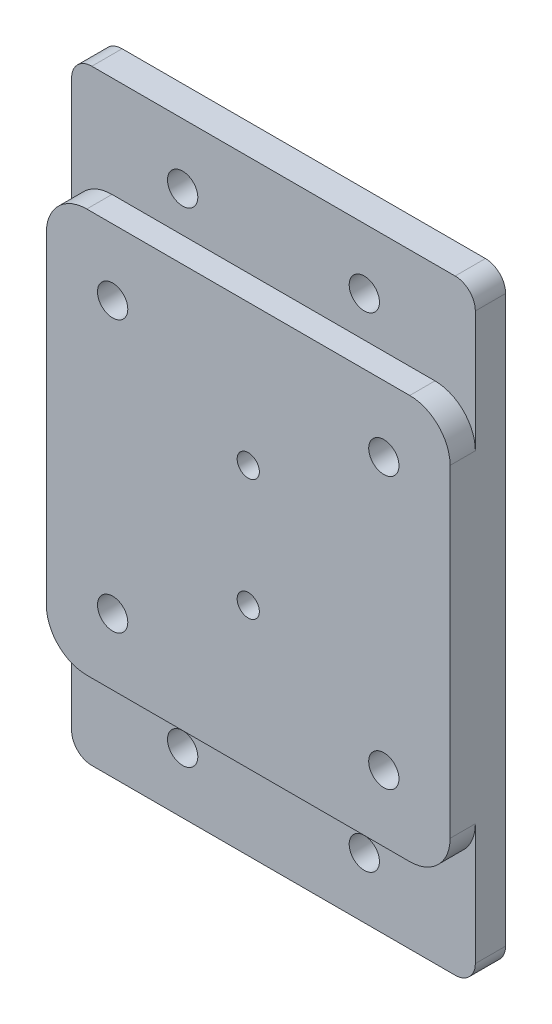
ISO-10303-21;
HEADER;
FILE_DESCRIPTION(('STEP AP214'),'2;1');
FILE_NAME('part.step','',(''),(''),'','','');
FILE_SCHEMA(('AUTOMOTIVE_DESIGN { 1 0 10303 214 1 1 1 1 }'));
ENDSEC;
DATA;
#1=APPLICATION_CONTEXT('core data for automotive mechanical design processes');
#2=APPLICATION_PROTOCOL_DEFINITION('international standard','automotive_design',2000,#1);
#3=PRODUCT_CONTEXT('',#1,'mechanical');
#4=PRODUCT('Part','Part','',(#3));
#5=PRODUCT_RELATED_PRODUCT_CATEGORY('part','',(#4));
#6=PRODUCT_DEFINITION_FORMATION('','',#4);
#7=PRODUCT_DEFINITION_CONTEXT('part definition',#1,'design');
#8=PRODUCT_DEFINITION('design','',#6,#7);
#9=PRODUCT_DEFINITION_SHAPE('','',#8);
#10=(LENGTH_UNIT() NAMED_UNIT(*) SI_UNIT(.MILLI.,.METRE.));
#11=(NAMED_UNIT(*) PLANE_ANGLE_UNIT() SI_UNIT($,.RADIAN.));
#12=(NAMED_UNIT(*) SI_UNIT($,.STERADIAN.) SOLID_ANGLE_UNIT());
#13=UNCERTAINTY_MEASURE_WITH_UNIT(LENGTH_MEASURE(1.E-05),#10,'distance_accuracy_value','');
#14=(GEOMETRIC_REPRESENTATION_CONTEXT(3) GLOBAL_UNCERTAINTY_ASSIGNED_CONTEXT((#13)) GLOBAL_UNIT_ASSIGNED_CONTEXT((#10,
#11,#12)) REPRESENTATION_CONTEXT('',''));
#15=CARTESIAN_POINT('',(0.,0.,0.));
#16=DIRECTION('',(0.,0.,1.));
#17=DIRECTION('',(1.,0.,0.));
#18=AXIS2_PLACEMENT_3D('',#15,#16,#17);
#19=CARTESIAN_POINT('',(-45.0628280341869,0.935555198313801,-3.));
#20=DIRECTION('',(0.,0.,1.));
#21=DIRECTION('',(1.,0.,0.));
#22=AXIS2_PLACEMENT_3D('',#19,#20,#21);
#23=CYLINDRICAL_SURFACE('',#22,1.10000034);
#24=CARTESIAN_POINT('',(-45.0628280341869,0.935555198313801,2.5));
#25=DIRECTION('',(0.,0.,1.));
#26=DIRECTION('',(1.,0.,0.));
#27=AXIS2_PLACEMENT_3D('',#24,#25,#26);
#28=CIRCLE('',#27,1.10000034);
#29=CARTESIAN_POINT('',(-43.9628276941869,0.935555198313801,2.5));
#30=VERTEX_POINT('',#29);
#31=EDGE_CURVE('E248',#30,#30,#28,.T.);
#32=ORIENTED_EDGE('',*,*,#31,.T.);
#33=EDGE_LOOP('',(#32));
#34=FACE_BOUND('',#33,.T.);
#35=CARTESIAN_POINT('',(-45.0628280341869,0.935555198313801,0.));
#36=DIRECTION('',(0.,0.,-1.));
#37=DIRECTION('',(-1.,0.,0.));
#38=AXIS2_PLACEMENT_3D('',#35,#36,#37);
#39=CIRCLE('',#38,1.10000034);
#40=CARTESIAN_POINT('',(-46.1628283741869,0.935555198313801,0.));
#41=VERTEX_POINT('',#40);
#42=EDGE_CURVE('E39',#41,#41,#39,.F.);
#43=ORIENTED_EDGE('',*,*,#42,.F.);
#44=EDGE_LOOP('',(#43));
#45=FACE_BOUND('',#44,.T.);
#46=ADVANCED_FACE('F35',(#34,#45),#23,.F.);
#47=CARTESIAN_POINT('',(-45.0628280341857,12.9355311983138,-3.));
#48=DIRECTION('',(0.,0.,1.));
#49=DIRECTION('',(1.,0.,0.));
#50=AXIS2_PLACEMENT_3D('',#47,#48,#49);
#51=CYLINDRICAL_SURFACE('',#50,1.10000033999999);
#52=CARTESIAN_POINT('',(-45.0628280341857,12.9355311983138,2.5));
#53=DIRECTION('',(0.,0.,1.));
#54=DIRECTION('',(1.,0.,0.));
#55=AXIS2_PLACEMENT_3D('',#52,#53,#54);
#56=CIRCLE('',#55,1.10000033999999);
#57=CARTESIAN_POINT('',(-43.9628276941857,12.9355311983138,2.5));
#58=VERTEX_POINT('',#57);
#59=EDGE_CURVE('E303',#58,#58,#56,.T.);
#60=ORIENTED_EDGE('',*,*,#59,.T.);
#61=EDGE_LOOP('',(#60));
#62=FACE_BOUND('',#61,.T.);
#63=CARTESIAN_POINT('',(-45.0628280341857,12.9355311983138,0.));
#64=DIRECTION('',(0.,0.,-1.));
#65=DIRECTION('',(-1.,0.,0.));
#66=AXIS2_PLACEMENT_3D('',#63,#64,#65);
#67=CIRCLE('',#66,1.10000033999999);
#68=CARTESIAN_POINT('',(-46.1628283741856,12.9355311983138,0.));
#69=VERTEX_POINT('',#68);
#70=EDGE_CURVE('E264',#69,#69,#67,.F.);
#71=ORIENTED_EDGE('',*,*,#70,.F.);
#72=EDGE_LOOP('',(#71));
#73=FACE_BOUND('',#72,.T.);
#74=ADVANCED_FACE('F437',(#62,#73),#51,.F.);
#75=CARTESIAN_POINT('',(-31.6277991916418,20.3705720408582,-3.));
#76=DIRECTION('',(0.,0.,1.));
#77=DIRECTION('',(1.,0.,0.));
#78=AXIS2_PLACEMENT_3D('',#75,#76,#77);
#79=CYLINDRICAL_SURFACE('',#78,1.5);
#80=CARTESIAN_POINT('',(-31.6277991916418,20.3705720408582,2.5));
#81=DIRECTION('',(0.,0.,1.));
#82=DIRECTION('',(1.,0.,0.));
#83=AXIS2_PLACEMENT_3D('',#80,#81,#82);
#84=CIRCLE('',#83,1.5);
#85=CARTESIAN_POINT('',(-30.1277991916418,20.3705720408582,2.5));
#86=VERTEX_POINT('',#85);
#87=EDGE_CURVE('E307',#86,#86,#84,.T.);
#88=ORIENTED_EDGE('',*,*,#87,.T.);
#89=EDGE_LOOP('',(#88));
#90=FACE_BOUND('',#89,.T.);
#91=CARTESIAN_POINT('',(-31.6277991916418,20.3705720408582,0.));
#92=DIRECTION('',(0.,0.,-1.));
#93=DIRECTION('',(-1.,0.,0.));
#94=AXIS2_PLACEMENT_3D('',#91,#92,#93);
#95=CIRCLE('',#94,1.5);
#96=CARTESIAN_POINT('',(-33.1277991916418,20.3705720408582,0.));
#97=VERTEX_POINT('',#96);
#98=EDGE_CURVE('E260',#97,#97,#95,.F.);
#99=ORIENTED_EDGE('',*,*,#98,.F.);
#100=EDGE_LOOP('',(#99));
#101=FACE_BOUND('',#100,.T.);
#102=ADVANCED_FACE('F444',(#90,#101),#79,.F.);
#103=CARTESIAN_POINT('',(-31.627799191642,-6.4994856442307,-3.));
#104=DIRECTION('',(0.,0.,1.));
#105=DIRECTION('',(1.,0.,0.));
#106=AXIS2_PLACEMENT_3D('',#103,#104,#105);
#107=CYLINDRICAL_SURFACE('',#106,1.5);
#108=CARTESIAN_POINT('',(-31.627799191642,-6.4994856442307,2.5));
#109=DIRECTION('',(0.,0.,1.));
#110=DIRECTION('',(1.,0.,0.));
#111=AXIS2_PLACEMENT_3D('',#108,#109,#110);
#112=CIRCLE('',#111,1.5);
#113=CARTESIAN_POINT('',(-30.1277991916419,-6.4994856442307,2.5));
#114=VERTEX_POINT('',#113);
#115=EDGE_CURVE('E311',#114,#114,#112,.T.);
#116=ORIENTED_EDGE('',*,*,#115,.T.);
#117=EDGE_LOOP('',(#116));
#118=FACE_BOUND('',#117,.T.);
#119=CARTESIAN_POINT('',(-31.627799191642,-6.4994856442307,0.));
#120=DIRECTION('',(0.,0.,-1.));
#121=DIRECTION('',(-1.,0.,0.));
#122=AXIS2_PLACEMENT_3D('',#119,#120,#121);
#123=CIRCLE('',#122,1.5);
#124=CARTESIAN_POINT('',(-33.127799191642,-6.4994856442307,0.));
#125=VERTEX_POINT('',#124);
#126=EDGE_CURVE('E255',#125,#125,#123,.F.);
#127=ORIENTED_EDGE('',*,*,#126,.F.);
#128=EDGE_LOOP('',(#127));
#129=FACE_BOUND('',#128,.T.);
#130=ADVANCED_FACE('F457',(#118,#129),#107,.F.);
#131=CARTESIAN_POINT('',(-58.4978568767306,-6.49948564423069,-3.));
#132=DIRECTION('',(0.,0.,1.));
#133=DIRECTION('',(1.,0.,0.));
#134=AXIS2_PLACEMENT_3D('',#131,#132,#133);
#135=CYLINDRICAL_SURFACE('',#134,1.5);
#136=CARTESIAN_POINT('',(-58.4978568767306,-6.49948564423069,2.5));
#137=DIRECTION('',(0.,0.,1.));
#138=DIRECTION('',(1.,0.,0.));
#139=AXIS2_PLACEMENT_3D('',#136,#137,#138);
#140=CIRCLE('',#139,1.5);
#141=CARTESIAN_POINT('',(-56.9978568767306,-6.49948564423069,2.5));
#142=VERTEX_POINT('',#141);
#143=EDGE_CURVE('E308',#142,#142,#140,.T.);
#144=ORIENTED_EDGE('',*,*,#143,.T.);
#145=EDGE_LOOP('',(#144));
#146=FACE_BOUND('',#145,.T.);
#147=CARTESIAN_POINT('',(-58.4978568767306,-6.49948564423069,0.));
#148=DIRECTION('',(0.,0.,-1.));
#149=DIRECTION('',(-1.,0.,0.));
#150=AXIS2_PLACEMENT_3D('',#147,#148,#149);
#151=CIRCLE('',#150,1.5);
#152=CARTESIAN_POINT('',(-59.9978568767306,-6.49948564423069,0.));
#153=VERTEX_POINT('',#152);
#154=EDGE_CURVE('E250',#153,#153,#151,.F.);
#155=ORIENTED_EDGE('',*,*,#154,.F.);
#156=EDGE_LOOP('',(#155));
#157=FACE_BOUND('',#156,.T.);
#158=ADVANCED_FACE('F453',(#146,#157),#135,.F.);
#159=CARTESIAN_POINT('',(-58.4978568767306,20.3705720408583,-3.));
#160=DIRECTION('',(0.,0.,1.));
#161=DIRECTION('',(1.,0.,0.));
#162=AXIS2_PLACEMENT_3D('',#159,#160,#161);
#163=CYLINDRICAL_SURFACE('',#162,1.5);
#164=CARTESIAN_POINT('',(-58.4978568767306,20.3705720408583,2.5));
#165=DIRECTION('',(0.,0.,1.));
#166=DIRECTION('',(1.,0.,0.));
#167=AXIS2_PLACEMENT_3D('',#164,#165,#166);
#168=CIRCLE('',#167,1.5);
#169=CARTESIAN_POINT('',(-56.9978568767306,20.3705720408583,2.5));
#170=VERTEX_POINT('',#169);
#171=EDGE_CURVE('E304',#170,#170,#168,.T.);
#172=ORIENTED_EDGE('',*,*,#171,.T.);
#173=EDGE_LOOP('',(#172));
#174=FACE_BOUND('',#173,.T.);
#175=CARTESIAN_POINT('',(-58.4978568767306,20.3705720408583,0.));
#176=DIRECTION('',(0.,0.,-1.));
#177=DIRECTION('',(-1.,0.,0.));
#178=AXIS2_PLACEMENT_3D('',#175,#176,#177);
#179=CIRCLE('',#178,1.5);
#180=CARTESIAN_POINT('',(-59.9978568767306,20.3705720408583,0.));
#181=VERTEX_POINT('',#180);
#182=EDGE_CURVE('E245',#181,#181,#179,.F.);
#183=ORIENTED_EDGE('',*,*,#182,.F.);
#184=EDGE_LOOP('',(#183));
#185=FACE_BOUND('',#184,.T.);
#186=ADVANCED_FACE('F450',(#174,#185),#163,.F.);
#187=CARTESIAN_POINT('',(-25.0628280341863,26.9355431983138,2.5));
#188=DIRECTION('',(-1.,0.,0.));
#189=DIRECTION('',(0.,-1.,0.));
#190=AXIS2_PLACEMENT_3D('',#187,#188,#189);
#191=PLANE('',#190);
#192=DIRECTION('',(0.,-1.,0.));
#193=VECTOR('',#192,1.);
#194=CARTESIAN_POINT('',(-25.0628280341863,36.9355431983138,0.));
#195=LINE('',#194,#193);
#196=CARTESIAN_POINT('',(-25.0628280341863,-9.06445680168622,0.));
#197=VERTEX_POINT('',#196);
#198=CARTESIAN_POINT('',(-25.0628280341863,-21.0644568016862,0.));
#199=VERTEX_POINT('',#198);
#200=EDGE_CURVE('E340',#197,#199,#195,.T.);
#201=ORIENTED_EDGE('',*,*,#200,.T.);
#202=DIRECTION('',(0.,0.,1.));
#203=VECTOR('',#202,1.);
#204=CARTESIAN_POINT('',(-25.0628280341863,-21.0644568016862,2.5));
#205=LINE('',#204,#203);
#206=CARTESIAN_POINT('',(-25.0628280341863,-21.0644568016862,-3.));
#207=VERTEX_POINT('',#206);
#208=EDGE_CURVE('E225',#199,#207,#205,.F.);
#209=ORIENTED_EDGE('',*,*,#208,.T.);
#210=DIRECTION('',(0.,-1.,0.));
#211=VECTOR('',#210,1.);
#212=CARTESIAN_POINT('',(-25.0628280341863,36.9355431983138,-3.));
#213=LINE('',#212,#211);
#214=CARTESIAN_POINT('',(-25.0628280341863,34.9355431983138,-3.));
#215=VERTEX_POINT('',#214);
#216=EDGE_CURVE('E343',#215,#207,#213,.T.);
#217=ORIENTED_EDGE('',*,*,#216,.F.);
#218=DIRECTION('',(0.,0.,1.));
#219=VECTOR('',#218,1.);
#220=CARTESIAN_POINT('',(-25.0628280341863,34.9355431983138,2.5));
#221=LINE('',#220,#219);
#222=CARTESIAN_POINT('',(-25.0628280341863,34.9355431983138,0.));
#223=VERTEX_POINT('',#222);
#224=EDGE_CURVE('E222',#215,#223,#221,.T.);
#225=ORIENTED_EDGE('',*,*,#224,.T.);
#226=CARTESIAN_POINT('',(-25.0628280341863,22.9355431983138,0.));
#227=VERTEX_POINT('',#226);
#228=EDGE_CURVE('E352',#223,#227,#195,.T.);
#229=ORIENTED_EDGE('',*,*,#228,.T.);
#230=DIRECTION('',(0.,0.,-1.));
#231=VECTOR('',#230,1.);
#232=CARTESIAN_POINT('',(-25.0628280341863,22.9355431983138,2.5));
#233=LINE('',#232,#231);
#234=CARTESIAN_POINT('',(-25.0628280341863,22.9355431983138,2.5));
#235=VERTEX_POINT('',#234);
#236=EDGE_CURVE('E155',#227,#235,#233,.F.);
#237=ORIENTED_EDGE('',*,*,#236,.T.);
#238=DIRECTION('',(0.,1.,0.));
#239=VECTOR('',#238,1.);
#240=CARTESIAN_POINT('',(-25.0628280341863,26.9355431983138,2.5));
#241=LINE('',#240,#239);
#242=CARTESIAN_POINT('',(-25.0628280341863,-9.06445680168622,2.5));
#243=VERTEX_POINT('',#242);
#244=EDGE_CURVE('E178',#243,#235,#241,.T.);
#245=ORIENTED_EDGE('',*,*,#244,.F.);
#246=DIRECTION('',(0.,0.,-1.));
#247=VECTOR('',#246,1.);
#248=CARTESIAN_POINT('',(-25.0628280341863,-9.06445680168622,2.5));
#249=LINE('',#248,#247);
#250=EDGE_CURVE('E168',#243,#197,#249,.T.);
#251=ORIENTED_EDGE('',*,*,#250,.T.);
#252=EDGE_LOOP('',(#201,#209,#217,#225,#229,#237,#245,#251));
#253=FACE_BOUND('',#252,.T.);
#254=ADVANCED_FACE('F382',(#253),#191,.F.);
#255=CARTESIAN_POINT('',(-25.0628280341863,26.9355431983138,2.5));
#256=DIRECTION('',(0.,-1.,0.));
#257=DIRECTION('',(1.,0.,0.));
#258=AXIS2_PLACEMENT_3D('',#255,#256,#257);
#259=PLANE('',#258);
#260=DIRECTION('',(-1.,0.,0.));
#261=VECTOR('',#260,1.);
#262=CARTESIAN_POINT('',(-25.0628280341863,26.9355431983138,2.5));
#263=LINE('',#262,#261);
#264=CARTESIAN_POINT('',(-29.0628280341863,26.9355431983138,2.5));
#265=VERTEX_POINT('',#264);
#266=CARTESIAN_POINT('',(-61.0628280341863,26.9355431983138,2.5));
#267=VERTEX_POINT('',#266);
#268=EDGE_CURVE('E167',#265,#267,#263,.T.);
#269=ORIENTED_EDGE('',*,*,#268,.F.);
#270=DIRECTION('',(0.,0.,-1.));
#271=VECTOR('',#270,1.);
#272=CARTESIAN_POINT('',(-29.0628280341863,26.9355431983138,2.5));
#273=LINE('',#272,#271);
#274=CARTESIAN_POINT('',(-29.0628280341863,26.9355431983138,0.));
#275=VERTEX_POINT('',#274);
#276=EDGE_CURVE('E154',#265,#275,#273,.T.);
#277=ORIENTED_EDGE('',*,*,#276,.T.);
#278=DIRECTION('',(-1.,0.,0.));
#279=VECTOR('',#278,1.);
#280=CARTESIAN_POINT('',(-25.0628280341863,26.9355431983138,0.));
#281=LINE('',#280,#279);
#282=CARTESIAN_POINT('',(-61.0628280341863,26.9355431983138,0.));
#283=VERTEX_POINT('',#282);
#284=EDGE_CURVE('E164',#275,#283,#281,.T.);
#285=ORIENTED_EDGE('',*,*,#284,.T.);
#286=DIRECTION('',(0.,0.,-1.));
#287=VECTOR('',#286,1.);
#288=CARTESIAN_POINT('',(-61.0628280341863,26.9355431983138,2.5));
#289=LINE('',#288,#287);
#290=EDGE_CURVE('E169',#283,#267,#289,.F.);
#291=ORIENTED_EDGE('',*,*,#290,.T.);
#292=EDGE_LOOP('',(#269,#277,#285,#291));
#293=FACE_BOUND('',#292,.T.);
#294=ADVANCED_FACE('F163',(#293),#259,.F.);
#295=CARTESIAN_POINT('',(-65.0628280341863,26.9355431983138,2.5));
#296=DIRECTION('',(1.,0.,0.));
#297=DIRECTION('',(0.,0.,-1.));
#298=AXIS2_PLACEMENT_3D('',#295,#296,#297);
#299=PLANE('',#298);
#300=DIRECTION('',(0.,1.,0.));
#301=VECTOR('',#300,1.);
#302=CARTESIAN_POINT('',(-65.0628280341863,36.9355431983138,-3.));
#303=LINE('',#302,#301);
#304=CARTESIAN_POINT('',(-65.0628280341863,-21.0644568016862,-3.));
#305=VERTEX_POINT('',#304);
#306=CARTESIAN_POINT('',(-65.0628280341863,34.9355431983138,-3.));
#307=VERTEX_POINT('',#306);
#308=EDGE_CURVE('E181',#305,#307,#303,.T.);
#309=ORIENTED_EDGE('',*,*,#308,.F.);
#310=DIRECTION('',(0.,0.,1.));
#311=VECTOR('',#310,1.);
#312=CARTESIAN_POINT('',(-65.0628280341863,-21.0644568016862,2.5));
#313=LINE('',#312,#311);
#314=CARTESIAN_POINT('',(-65.0628280341863,-21.0644568016862,0.));
#315=VERTEX_POINT('',#314);
#316=EDGE_CURVE('E237',#305,#315,#313,.T.);
#317=ORIENTED_EDGE('',*,*,#316,.T.);
#318=DIRECTION('',(0.,1.,0.));
#319=VECTOR('',#318,1.);
#320=CARTESIAN_POINT('',(-65.0628280341863,36.9355431983138,0.));
#321=LINE('',#320,#319);
#322=CARTESIAN_POINT('',(-65.0628280341863,-9.06445680168622,0.));
#323=VERTEX_POINT('',#322);
#324=EDGE_CURVE('E358',#315,#323,#321,.T.);
#325=ORIENTED_EDGE('',*,*,#324,.T.);
#326=DIRECTION('',(0.,0.,-1.));
#327=VECTOR('',#326,1.);
#328=CARTESIAN_POINT('',(-65.0628280341863,-9.06445680168622,2.5));
#329=LINE('',#328,#327);
#330=CARTESIAN_POINT('',(-65.0628280341863,-9.06445680168622,2.5));
#331=VERTEX_POINT('',#330);
#332=EDGE_CURVE('E158',#323,#331,#329,.F.);
#333=ORIENTED_EDGE('',*,*,#332,.T.);
#334=DIRECTION('',(0.,-1.,0.));
#335=VECTOR('',#334,1.);
#336=CARTESIAN_POINT('',(-65.0628280341863,26.9355431983138,2.5));
#337=LINE('',#336,#335);
#338=CARTESIAN_POINT('',(-65.0628280341863,22.9355431983138,2.5));
#339=VERTEX_POINT('',#338);
#340=EDGE_CURVE('E363',#339,#331,#337,.T.);
#341=ORIENTED_EDGE('',*,*,#340,.F.);
#342=DIRECTION('',(0.,0.,-1.));
#343=VECTOR('',#342,1.);
#344=CARTESIAN_POINT('',(-65.0628280341863,22.9355431983138,2.5));
#345=LINE('',#344,#343);
#346=CARTESIAN_POINT('',(-65.0628280341863,22.9355431983138,0.));
#347=VERTEX_POINT('',#346);
#348=EDGE_CURVE('E204',#339,#347,#345,.T.);
#349=ORIENTED_EDGE('',*,*,#348,.T.);
#350=CARTESIAN_POINT('',(-65.0628280341863,34.9355431983138,0.));
#351=VERTEX_POINT('',#350);
#352=EDGE_CURVE('E357',#347,#351,#321,.T.);
#353=ORIENTED_EDGE('',*,*,#352,.T.);
#354=DIRECTION('',(0.,0.,1.));
#355=VECTOR('',#354,1.);
#356=CARTESIAN_POINT('',(-65.0628280341863,34.9355431983138,2.5));
#357=LINE('',#356,#355);
#358=EDGE_CURVE('E235',#351,#307,#357,.F.);
#359=ORIENTED_EDGE('',*,*,#358,.T.);
#360=EDGE_LOOP('',(#309,#317,#325,#333,#341,#349,#353,#359));
#361=FACE_BOUND('',#360,.T.);
#362=ADVANCED_FACE('F391',(#361),#299,.F.);
#363=CARTESIAN_POINT('',(-25.0628280341863,-13.0644568016862,2.5));
#364=DIRECTION('',(0.,1.,0.));
#365=DIRECTION('',(-1.,0.,0.));
#366=AXIS2_PLACEMENT_3D('',#363,#364,#365);
#367=PLANE('',#366);
#368=DIRECTION('',(1.,0.,0.));
#369=VECTOR('',#368,1.);
#370=CARTESIAN_POINT('',(-25.0628280341863,-13.0644568016862,0.));
#371=LINE('',#370,#369);
#372=CARTESIAN_POINT('',(-61.0628280341863,-13.0644568016862,0.));
#373=VERTEX_POINT('',#372);
#374=CARTESIAN_POINT('',(-29.0628280341863,-13.0644568016862,0.));
#375=VERTEX_POINT('',#374);
#376=EDGE_CURVE('E174',#373,#375,#371,.T.);
#377=ORIENTED_EDGE('',*,*,#376,.T.);
#378=DIRECTION('',(0.,0.,-1.));
#379=VECTOR('',#378,1.);
#380=CARTESIAN_POINT('',(-29.0628280341863,-13.0644568016862,2.5));
#381=LINE('',#380,#379);
#382=CARTESIAN_POINT('',(-29.0628280341863,-13.0644568016862,2.5));
#383=VERTEX_POINT('',#382);
#384=EDGE_CURVE('E202',#375,#383,#381,.F.);
#385=ORIENTED_EDGE('',*,*,#384,.T.);
#386=DIRECTION('',(1.,0.,0.));
#387=VECTOR('',#386,1.);
#388=CARTESIAN_POINT('',(-25.0628280341863,-13.0644568016862,2.5));
#389=LINE('',#388,#387);
#390=CARTESIAN_POINT('',(-61.0628280341863,-13.0644568016862,2.5));
#391=VERTEX_POINT('',#390);
#392=EDGE_CURVE('E184',#391,#383,#389,.T.);
#393=ORIENTED_EDGE('',*,*,#392,.F.);
#394=DIRECTION('',(0.,0.,-1.));
#395=VECTOR('',#394,1.);
#396=CARTESIAN_POINT('',(-61.0628280341863,-13.0644568016862,2.5));
#397=LINE('',#396,#395);
#398=EDGE_CURVE('E199',#391,#373,#397,.T.);
#399=ORIENTED_EDGE('',*,*,#398,.T.);
#400=EDGE_LOOP('',(#377,#385,#393,#399));
#401=FACE_BOUND('',#400,.T.);
#402=ADVANCED_FACE('F397',(#401),#367,.F.);
#403=CARTESIAN_POINT('',(0.,0.,2.5));
#404=DIRECTION('',(0.,0.,-1.));
#405=DIRECTION('',(-1.,0.,0.));
#406=AXIS2_PLACEMENT_3D('',#403,#404,#405);
#407=PLANE('',#406);
#408=ORIENTED_EDGE('',*,*,#171,.F.);
#409=EDGE_LOOP('',(#408));
#410=FACE_BOUND('',#409,.T.);
#411=ORIENTED_EDGE('',*,*,#143,.F.);
#412=EDGE_LOOP('',(#411));
#413=FACE_BOUND('',#412,.T.);
#414=ORIENTED_EDGE('',*,*,#115,.F.);
#415=EDGE_LOOP('',(#414));
#416=FACE_BOUND('',#415,.T.);
#417=ORIENTED_EDGE('',*,*,#59,.F.);
#418=EDGE_LOOP('',(#417));
#419=FACE_BOUND('',#418,.T.);
#420=ORIENTED_EDGE('',*,*,#31,.F.);
#421=EDGE_LOOP('',(#420));
#422=FACE_BOUND('',#421,.T.);
#423=ORIENTED_EDGE('',*,*,#87,.F.);
#424=EDGE_LOOP('',(#423));
#425=FACE_BOUND('',#424,.T.);
#426=ORIENTED_EDGE('',*,*,#244,.T.);
#427=CARTESIAN_POINT('',(-29.0628280341863,22.9355431983138,2.5));
#428=DIRECTION('',(0.,0.,-1.));
#429=DIRECTION('',(-1.,0.,0.));
#430=AXIS2_PLACEMENT_3D('',#427,#428,#429);
#431=CIRCLE('',#430,4.);
#432=EDGE_CURVE('E197',#235,#265,#431,.F.);
#433=ORIENTED_EDGE('',*,*,#432,.T.);
#434=ORIENTED_EDGE('',*,*,#268,.T.);
#435=CARTESIAN_POINT('',(-61.0628280341863,22.9355431983138,2.5));
#436=DIRECTION('',(0.,0.,-1.));
#437=DIRECTION('',(-1.,0.,0.));
#438=AXIS2_PLACEMENT_3D('',#435,#436,#437);
#439=CIRCLE('',#438,4.);
#440=EDGE_CURVE('E191',#267,#339,#439,.F.);
#441=ORIENTED_EDGE('',*,*,#440,.T.);
#442=ORIENTED_EDGE('',*,*,#340,.T.);
#443=CARTESIAN_POINT('',(-61.0628280341863,-9.06445680168622,2.5));
#444=DIRECTION('',(0.,0.,-1.));
#445=DIRECTION('',(-1.,0.,0.));
#446=AXIS2_PLACEMENT_3D('',#443,#444,#445);
#447=CIRCLE('',#446,4.);
#448=EDGE_CURVE('E193',#331,#391,#447,.F.);
#449=ORIENTED_EDGE('',*,*,#448,.T.);
#450=ORIENTED_EDGE('',*,*,#392,.T.);
#451=CARTESIAN_POINT('',(-29.0628280341863,-9.06445680168622,2.5));
#452=DIRECTION('',(0.,0.,-1.));
#453=DIRECTION('',(-1.,0.,0.));
#454=AXIS2_PLACEMENT_3D('',#451,#452,#453);
#455=CIRCLE('',#454,4.);
#456=EDGE_CURVE('E195',#383,#243,#455,.F.);
#457=ORIENTED_EDGE('',*,*,#456,.T.);
#458=EDGE_LOOP('',(#426,#433,#434,#441,#442,#449,#450,#457));
#459=FACE_BOUND('',#458,.T.);
#460=ADVANCED_FACE('F371',(#410,#413,#416,#419,#422,#425,#459),#407,.F.);
#461=CARTESIAN_POINT('',(0.,0.,0.));
#462=DIRECTION('',(0.,0.,1.));
#463=DIRECTION('',(1.,0.,0.));
#464=AXIS2_PLACEMENT_3D('',#461,#462,#463);
#465=PLANE('',#464);
#466=CARTESIAN_POINT('',(-36.0628280341863,-17.0644568016862,0.));
#467=DIRECTION('',(0.,0.,-1.));
#468=DIRECTION('',(-1.,0.,0.));
#469=AXIS2_PLACEMENT_3D('',#466,#467,#468);
#470=CIRCLE('',#469,1.5);
#471=CARTESIAN_POINT('',(-37.5628280341863,-17.0644568016862,0.));
#472=VERTEX_POINT('',#471);
#473=EDGE_CURVE('E318',#472,#472,#470,.T.);
#474=ORIENTED_EDGE('',*,*,#473,.T.);
#475=EDGE_LOOP('',(#474));
#476=FACE_BOUND('',#475,.T.);
#477=CARTESIAN_POINT('',(-54.0628280341863,-17.0644568016862,0.));
#478=DIRECTION('',(0.,0.,-1.));
#479=DIRECTION('',(-1.,0.,0.));
#480=AXIS2_PLACEMENT_3D('',#477,#478,#479);
#481=CIRCLE('',#480,1.5);
#482=CARTESIAN_POINT('',(-55.5628280341863,-17.0644568016862,0.));
#483=VERTEX_POINT('',#482);
#484=EDGE_CURVE('E322',#483,#483,#481,.T.);
#485=ORIENTED_EDGE('',*,*,#484,.T.);
#486=EDGE_LOOP('',(#485));
#487=FACE_BOUND('',#486,.T.);
#488=DIRECTION('',(-1.,0.,0.));
#489=VECTOR('',#488,1.);
#490=CARTESIAN_POINT('',(-65.0628280341863,-23.0644568016862,0.));
#491=LINE('',#490,#489);
#492=CARTESIAN_POINT('',(-27.0628280341863,-23.0644568016862,0.));
#493=VERTEX_POINT('',#492);
#494=CARTESIAN_POINT('',(-63.0628280341863,-23.0644568016862,0.));
#495=VERTEX_POINT('',#494);
#496=EDGE_CURVE('E354',#493,#495,#491,.T.);
#497=ORIENTED_EDGE('',*,*,#496,.F.);
#498=CARTESIAN_POINT('',(-27.0628280341863,-21.0644568016862,0.));
#499=DIRECTION('',(0.,0.,1.));
#500=DIRECTION('',(1.,0.,0.));
#501=AXIS2_PLACEMENT_3D('',#498,#499,#500);
#502=CIRCLE('',#501,2.);
#503=EDGE_CURVE('E220',#493,#199,#502,.T.);
#504=ORIENTED_EDGE('',*,*,#503,.T.);
#505=ORIENTED_EDGE('',*,*,#200,.F.);
#506=CARTESIAN_POINT('',(-29.0628280341863,-9.06445680168622,0.));
#507=DIRECTION('',(0.,0.,1.));
#508=DIRECTION('',(1.,0.,0.));
#509=AXIS2_PLACEMENT_3D('',#506,#507,#508);
#510=CIRCLE('',#509,4.);
#511=EDGE_CURVE('E157',#197,#375,#510,.F.);
#512=ORIENTED_EDGE('',*,*,#511,.T.);
#513=ORIENTED_EDGE('',*,*,#376,.F.);
#514=CARTESIAN_POINT('',(-61.0628280341863,-9.06445680168622,0.));
#515=DIRECTION('',(0.,0.,1.));
#516=DIRECTION('',(1.,0.,0.));
#517=AXIS2_PLACEMENT_3D('',#514,#515,#516);
#518=CIRCLE('',#517,4.);
#519=EDGE_CURVE('E209',#373,#323,#518,.F.);
#520=ORIENTED_EDGE('',*,*,#519,.T.);
#521=ORIENTED_EDGE('',*,*,#324,.F.);
#522=CARTESIAN_POINT('',(-63.0628280341863,-21.0644568016862,0.));
#523=DIRECTION('',(0.,0.,1.));
#524=DIRECTION('',(1.,0.,0.));
#525=AXIS2_PLACEMENT_3D('',#522,#523,#524);
#526=CIRCLE('',#525,2.);
#527=EDGE_CURVE('E218',#315,#495,#526,.T.);
#528=ORIENTED_EDGE('',*,*,#527,.T.);
#529=EDGE_LOOP('',(#497,#504,#505,#512,#513,#520,#521,#528));
#530=FACE_BOUND('',#529,.T.);
#531=ADVANCED_FACE('F400',(#476,#487,#530),#465,.T.);
#532=CARTESIAN_POINT('',(-54.0628280341863,30.9355431983138,0.));
#533=DIRECTION('',(0.,0.,-1.));
#534=DIRECTION('',(-1.,0.,0.));
#535=AXIS2_PLACEMENT_3D('',#532,#533,#534);
#536=CIRCLE('',#535,1.5);
#537=CARTESIAN_POINT('',(-55.5628280341863,30.9355431983138,0.));
#538=VERTEX_POINT('',#537);
#539=EDGE_CURVE('E328',#538,#538,#536,.T.);
#540=ORIENTED_EDGE('',*,*,#539,.T.);
#541=EDGE_LOOP('',(#540));
#542=FACE_BOUND('',#541,.T.);
#543=CARTESIAN_POINT('',(-36.0628280341863,30.9355431983138,0.));
#544=DIRECTION('',(0.,0.,-1.));
#545=DIRECTION('',(-1.,0.,0.));
#546=AXIS2_PLACEMENT_3D('',#543,#544,#545);
#547=CIRCLE('',#546,1.5);
#548=CARTESIAN_POINT('',(-37.5628280341863,30.9355431983138,0.));
#549=VERTEX_POINT('',#548);
#550=EDGE_CURVE('E334',#549,#549,#547,.T.);
#551=ORIENTED_EDGE('',*,*,#550,.T.);
#552=EDGE_LOOP('',(#551));
#553=FACE_BOUND('',#552,.T.);
#554=DIRECTION('',(1.,0.,0.));
#555=VECTOR('',#554,1.);
#556=CARTESIAN_POINT('',(-65.0628280341863,36.9355431983138,0.));
#557=LINE('',#556,#555);
#558=CARTESIAN_POINT('',(-63.0628280341863,36.9355431983138,0.));
#559=VERTEX_POINT('',#558);
#560=CARTESIAN_POINT('',(-27.0628280341863,36.9355431983138,0.));
#561=VERTEX_POINT('',#560);
#562=EDGE_CURVE('E347',#559,#561,#557,.T.);
#563=ORIENTED_EDGE('',*,*,#562,.F.);
#564=CARTESIAN_POINT('',(-63.0628280341863,34.9355431983138,0.));
#565=DIRECTION('',(0.,0.,1.));
#566=DIRECTION('',(1.,0.,0.));
#567=AXIS2_PLACEMENT_3D('',#564,#565,#566);
#568=CIRCLE('',#567,2.);
#569=EDGE_CURVE('E11',#559,#351,#568,.T.);
#570=ORIENTED_EDGE('',*,*,#569,.T.);
#571=ORIENTED_EDGE('',*,*,#352,.F.);
#572=CARTESIAN_POINT('',(-61.0628280341863,22.9355431983138,0.));
#573=DIRECTION('',(0.,0.,1.));
#574=DIRECTION('',(1.,0.,0.));
#575=AXIS2_PLACEMENT_3D('',#572,#573,#574);
#576=CIRCLE('',#575,4.);
#577=EDGE_CURVE('E173',#347,#283,#576,.F.);
#578=ORIENTED_EDGE('',*,*,#577,.T.);
#579=ORIENTED_EDGE('',*,*,#284,.F.);
#580=CARTESIAN_POINT('',(-29.0628280341863,22.9355431983138,0.));
#581=DIRECTION('',(0.,0.,1.));
#582=DIRECTION('',(1.,0.,0.));
#583=AXIS2_PLACEMENT_3D('',#580,#581,#582);
#584=CIRCLE('',#583,4.);
#585=EDGE_CURVE('E150',#275,#227,#584,.F.);
#586=ORIENTED_EDGE('',*,*,#585,.T.);
#587=ORIENTED_EDGE('',*,*,#228,.F.);
#588=CARTESIAN_POINT('',(-27.0628280341863,34.9355431983138,0.));
#589=DIRECTION('',(0.,0.,1.));
#590=DIRECTION('',(1.,0.,0.));
#591=AXIS2_PLACEMENT_3D('',#588,#589,#590);
#592=CIRCLE('',#591,2.);
#593=EDGE_CURVE('E44',#223,#561,#592,.T.);
#594=ORIENTED_EDGE('',*,*,#593,.T.);
#595=EDGE_LOOP('',(#563,#570,#571,#578,#579,#586,#587,#594));
#596=FACE_BOUND('',#595,.T.);
#597=ADVANCED_FACE('F171',(#542,#553,#596),#465,.T.);
#598=CARTESIAN_POINT('',(0.,0.,-3.));
#599=DIRECTION('',(0.,0.,1.));
#600=DIRECTION('',(1.,0.,0.));
#601=AXIS2_PLACEMENT_3D('',#598,#599,#600);
#602=PLANE('',#601);
#603=CARTESIAN_POINT('',(-45.0628280341857,12.9355311983138,-3.));
#604=DIRECTION('',(0.,0.,-1.));
#605=DIRECTION('',(-1.,0.,0.));
#606=AXIS2_PLACEMENT_3D('',#603,#604,#605);
#607=CIRCLE('',#606,2.);
#608=CARTESIAN_POINT('',(-47.0628280341857,12.9355311983138,-3.));
#609=VERTEX_POINT('',#608);
#610=EDGE_CURVE('E272',#609,#609,#607,.T.);
#611=ORIENTED_EDGE('',*,*,#610,.F.);
#612=EDGE_LOOP('',(#611));
#613=FACE_BOUND('',#612,.T.);
#614=CARTESIAN_POINT('',(-45.0628280341869,0.935555198313801,-3.));
#615=DIRECTION('',(0.,0.,-1.));
#616=DIRECTION('',(-1.,0.,0.));
#617=AXIS2_PLACEMENT_3D('',#614,#615,#616);
#618=CIRCLE('',#617,2.);
#619=CARTESIAN_POINT('',(-47.0628280341869,0.935555198313801,-3.));
#620=VERTEX_POINT('',#619);
#621=EDGE_CURVE('E282',#620,#620,#618,.T.);
#622=ORIENTED_EDGE('',*,*,#621,.F.);
#623=EDGE_LOOP('',(#622));
#624=FACE_BOUND('',#623,.T.);
#625=CARTESIAN_POINT('',(-31.627799191642,20.3705720408583,-3.));
#626=DIRECTION('',(0.,0.,1.));
#627=DIRECTION('',(1.,0.,0.));
#628=AXIS2_PLACEMENT_3D('',#625,#626,#627);
#629=CIRCLE('',#628,3.);
#630=CARTESIAN_POINT('',(-28.627799191642,20.3705720408583,-3.));
#631=VERTEX_POINT('',#630);
#632=EDGE_CURVE('E270',#631,#631,#629,.T.);
#633=ORIENTED_EDGE('',*,*,#632,.T.);
#634=EDGE_LOOP('',(#633));
#635=FACE_BOUND('',#634,.T.);
#636=CARTESIAN_POINT('',(-31.627799191642,-6.49948564423067,-3.));
#637=DIRECTION('',(0.,0.,-1.));
#638=DIRECTION('',(1.,0.,0.));
#639=AXIS2_PLACEMENT_3D('',#636,#637,#638);
#640=CIRCLE('',#639,3.);
#641=CARTESIAN_POINT('',(-28.627799191642,-6.49948564423067,-3.));
#642=VERTEX_POINT('',#641);
#643=EDGE_CURVE('E262',#642,#642,#640,.T.);
#644=ORIENTED_EDGE('',*,*,#643,.F.);
#645=EDGE_LOOP('',(#644));
#646=FACE_BOUND('',#645,.T.);
#647=CARTESIAN_POINT('',(-58.4978568767306,-6.49948564423067,-3.));
#648=DIRECTION('',(0.,0.,1.));
#649=DIRECTION('',(-1.,0.,0.));
#650=AXIS2_PLACEMENT_3D('',#647,#648,#649);
#651=CIRCLE('',#650,3.);
#652=CARTESIAN_POINT('',(-61.4978568767306,-6.49948564423067,-3.));
#653=VERTEX_POINT('',#652);
#654=EDGE_CURVE('E258',#653,#653,#651,.T.);
#655=ORIENTED_EDGE('',*,*,#654,.T.);
#656=EDGE_LOOP('',(#655));
#657=FACE_BOUND('',#656,.T.);
#658=CARTESIAN_POINT('',(-58.4978568767306,20.3705720408583,-3.));
#659=DIRECTION('',(0.,0.,-1.));
#660=DIRECTION('',(-1.,0.,0.));
#661=AXIS2_PLACEMENT_3D('',#658,#659,#660);
#662=CIRCLE('',#661,3.);
#663=CARTESIAN_POINT('',(-61.4978568767306,20.3705720408583,-3.));
#664=VERTEX_POINT('',#663);
#665=EDGE_CURVE('E253',#664,#664,#662,.T.);
#666=ORIENTED_EDGE('',*,*,#665,.F.);
#667=EDGE_LOOP('',(#666));
#668=FACE_BOUND('',#667,.T.);
#669=ORIENTED_EDGE('',*,*,#216,.T.);
#670=CARTESIAN_POINT('',(-27.0628280341863,-21.0644568016862,-3.));
#671=DIRECTION('',(0.,0.,1.));
#672=DIRECTION('',(1.,0.,0.));
#673=AXIS2_PLACEMENT_3D('',#670,#671,#672);
#674=CIRCLE('',#673,2.);
#675=CARTESIAN_POINT('',(-27.0628280341863,-23.0644568016862,-3.));
#676=VERTEX_POINT('',#675);
#677=EDGE_CURVE('E233',#207,#676,#674,.F.);
#678=ORIENTED_EDGE('',*,*,#677,.T.);
#679=DIRECTION('',(-1.,0.,0.));
#680=VECTOR('',#679,1.);
#681=CARTESIAN_POINT('',(-65.0628280341863,-23.0644568016862,-3.));
#682=LINE('',#681,#680);
#683=CARTESIAN_POINT('',(-63.0628280341863,-23.0644568016862,-3.));
#684=VERTEX_POINT('',#683);
#685=EDGE_CURVE('E346',#676,#684,#682,.T.);
#686=ORIENTED_EDGE('',*,*,#685,.T.);
#687=CARTESIAN_POINT('',(-63.0628280341863,-21.0644568016862,-3.));
#688=DIRECTION('',(0.,0.,1.));
#689=DIRECTION('',(1.,0.,0.));
#690=AXIS2_PLACEMENT_3D('',#687,#688,#689);
#691=CIRCLE('',#690,2.);
#692=EDGE_CURVE('E231',#684,#305,#691,.F.);
#693=ORIENTED_EDGE('',*,*,#692,.T.);
#694=ORIENTED_EDGE('',*,*,#308,.T.);
#695=CARTESIAN_POINT('',(-63.0628280341863,34.9355431983138,-3.));
#696=DIRECTION('',(0.,0.,1.));
#697=DIRECTION('',(1.,0.,0.));
#698=AXIS2_PLACEMENT_3D('',#695,#696,#697);
#699=CIRCLE('',#698,2.);
#700=CARTESIAN_POINT('',(-63.0628280341863,36.9355431983138,-3.));
#701=VERTEX_POINT('',#700);
#702=EDGE_CURVE('E229',#307,#701,#699,.F.);
#703=ORIENTED_EDGE('',*,*,#702,.T.);
#704=DIRECTION('',(1.,0.,0.));
#705=VECTOR('',#704,1.);
#706=CARTESIAN_POINT('',(-65.0628280341863,36.9355431983138,-3.));
#707=LINE('',#706,#705);
#708=CARTESIAN_POINT('',(-27.0628280341863,36.9355431983138,-3.));
#709=VERTEX_POINT('',#708);
#710=EDGE_CURVE('E175',#701,#709,#707,.T.);
#711=ORIENTED_EDGE('',*,*,#710,.T.);
#712=CARTESIAN_POINT('',(-27.0628280341863,34.9355431983138,-3.));
#713=DIRECTION('',(0.,0.,1.));
#714=DIRECTION('',(1.,0.,0.));
#715=AXIS2_PLACEMENT_3D('',#712,#713,#714);
#716=CIRCLE('',#715,2.);
#717=EDGE_CURVE('E227',#709,#215,#716,.F.);
#718=ORIENTED_EDGE('',*,*,#717,.T.);
#719=EDGE_LOOP('',(#669,#678,#686,#693,#694,#703,#711,#718));
#720=FACE_BOUND('',#719,.T.);
#721=CARTESIAN_POINT('',(-36.0628280341863,30.9355431983138,-3.));
#722=DIRECTION('',(0.,0.,-1.));
#723=DIRECTION('',(-1.,0.,0.));
#724=AXIS2_PLACEMENT_3D('',#721,#722,#723);
#725=CIRCLE('',#724,1.5);
#726=CARTESIAN_POINT('',(-37.5628280341863,30.9355431983138,-3.));
#727=VERTEX_POINT('',#726);
#728=EDGE_CURVE('E337',#727,#727,#725,.T.);
#729=ORIENTED_EDGE('',*,*,#728,.F.);
#730=EDGE_LOOP('',(#729));
#731=FACE_BOUND('',#730,.T.);
#732=CARTESIAN_POINT('',(-54.0628280341863,30.9355431983138,-3.));
#733=DIRECTION('',(0.,0.,-1.));
#734=DIRECTION('',(-1.,0.,0.));
#735=AXIS2_PLACEMENT_3D('',#732,#733,#734);
#736=CIRCLE('',#735,1.5);
#737=CARTESIAN_POINT('',(-55.5628280341863,30.9355431983138,-3.));
#738=VERTEX_POINT('',#737);
#739=EDGE_CURVE('E331',#738,#738,#736,.T.);
#740=ORIENTED_EDGE('',*,*,#739,.F.);
#741=EDGE_LOOP('',(#740));
#742=FACE_BOUND('',#741,.T.);
#743=CARTESIAN_POINT('',(-54.0628280341863,-17.0644568016862,-3.));
#744=DIRECTION('',(0.,0.,-1.));
#745=DIRECTION('',(-1.,0.,0.));
#746=AXIS2_PLACEMENT_3D('',#743,#744,#745);
#747=CIRCLE('',#746,1.5);
#748=CARTESIAN_POINT('',(-55.5628280341863,-17.0644568016862,-3.));
#749=VERTEX_POINT('',#748);
#750=EDGE_CURVE('E325',#749,#749,#747,.T.);
#751=ORIENTED_EDGE('',*,*,#750,.F.);
#752=EDGE_LOOP('',(#751));
#753=FACE_BOUND('',#752,.T.);
#754=CARTESIAN_POINT('',(-36.0628280341863,-17.0644568016862,-3.));
#755=DIRECTION('',(0.,0.,-1.));
#756=DIRECTION('',(-1.,0.,0.));
#757=AXIS2_PLACEMENT_3D('',#754,#755,#756);
#758=CIRCLE('',#757,1.5);
#759=CARTESIAN_POINT('',(-37.5628280341863,-17.0644568016862,-3.));
#760=VERTEX_POINT('',#759);
#761=EDGE_CURVE('E319',#760,#760,#758,.T.);
#762=ORIENTED_EDGE('',*,*,#761,.F.);
#763=EDGE_LOOP('',(#762));
#764=FACE_BOUND('',#763,.T.);
#765=ADVANCED_FACE('F411',(#613,#624,#635,#646,#657,#668,#720,#731,#742,#753,#764),#602,.F.);
#766=CARTESIAN_POINT('',(-65.0628280341863,-23.0644568016862,-3.));
#767=DIRECTION('',(0.,1.,0.));
#768=DIRECTION('',(0.,0.,1.));
#769=AXIS2_PLACEMENT_3D('',#766,#767,#768);
#770=PLANE('',#769);
#771=ORIENTED_EDGE('',*,*,#685,.F.);
#772=DIRECTION('',(0.,0.,1.));
#773=VECTOR('',#772,1.);
#774=CARTESIAN_POINT('',(-27.0628280341863,-23.0644568016862,-3.));
#775=LINE('',#774,#773);
#776=EDGE_CURVE('E215',#676,#493,#775,.T.);
#777=ORIENTED_EDGE('',*,*,#776,.T.);
#778=ORIENTED_EDGE('',*,*,#496,.T.);
#779=DIRECTION('',(0.,0.,1.));
#780=VECTOR('',#779,1.);
#781=CARTESIAN_POINT('',(-63.0628280341863,-23.0644568016862,-3.));
#782=LINE('',#781,#780);
#783=EDGE_CURVE('E213',#495,#684,#782,.F.);
#784=ORIENTED_EDGE('',*,*,#783,.T.);
#785=EDGE_LOOP('',(#771,#777,#778,#784));
#786=FACE_BOUND('',#785,.T.);
#787=ADVANCED_FACE('F407',(#786),#770,.F.);
#788=CARTESIAN_POINT('',(-65.0628280341863,36.9355431983138,-3.));
#789=DIRECTION('',(0.,-1.,0.));
#790=DIRECTION('',(0.,0.,-1.));
#791=AXIS2_PLACEMENT_3D('',#788,#789,#790);
#792=PLANE('',#791);
#793=ORIENTED_EDGE('',*,*,#710,.F.);
#794=DIRECTION('',(0.,0.,1.));
#795=VECTOR('',#794,1.);
#796=CARTESIAN_POINT('',(-63.0628280341863,36.9355431983138,-3.));
#797=LINE('',#796,#795);
#798=EDGE_CURVE('E242',#701,#559,#797,.T.);
#799=ORIENTED_EDGE('',*,*,#798,.T.);
#800=ORIENTED_EDGE('',*,*,#562,.T.);
#801=DIRECTION('',(0.,0.,1.));
#802=VECTOR('',#801,1.);
#803=CARTESIAN_POINT('',(-27.0628280341863,36.9355431983138,-3.));
#804=LINE('',#803,#802);
#805=EDGE_CURVE('E240',#561,#709,#804,.F.);
#806=ORIENTED_EDGE('',*,*,#805,.T.);
#807=EDGE_LOOP('',(#793,#799,#800,#806));
#808=FACE_BOUND('',#807,.T.);
#809=ADVANCED_FACE('F420',(#808),#792,.F.);
#810=CARTESIAN_POINT('',(-36.0628280341863,30.9355431983138,-3.));
#811=DIRECTION('',(0.,0.,1.));
#812=DIRECTION('',(1.,0.,0.));
#813=AXIS2_PLACEMENT_3D('',#810,#811,#812);
#814=CYLINDRICAL_SURFACE('',#813,1.5);
#815=ORIENTED_EDGE('',*,*,#728,.T.);
#816=EDGE_LOOP('',(#815));
#817=FACE_BOUND('',#816,.T.);
#818=ORIENTED_EDGE('',*,*,#550,.F.);
#819=EDGE_LOOP('',(#818));
#820=FACE_BOUND('',#819,.T.);
#821=ADVANCED_FACE('F476',(#817,#820),#814,.F.);
#822=CARTESIAN_POINT('',(-54.0628280341863,30.9355431983138,-3.));
#823=DIRECTION('',(0.,0.,1.));
#824=DIRECTION('',(1.,0.,0.));
#825=AXIS2_PLACEMENT_3D('',#822,#823,#824);
#826=CYLINDRICAL_SURFACE('',#825,1.5);
#827=ORIENTED_EDGE('',*,*,#739,.T.);
#828=EDGE_LOOP('',(#827));
#829=FACE_BOUND('',#828,.T.);
#830=ORIENTED_EDGE('',*,*,#539,.F.);
#831=EDGE_LOOP('',(#830));
#832=FACE_BOUND('',#831,.T.);
#833=ADVANCED_FACE('F472',(#829,#832),#826,.F.);
#834=CARTESIAN_POINT('',(-54.0628280341863,-17.0644568016862,-3.));
#835=DIRECTION('',(0.,0.,1.));
#836=DIRECTION('',(1.,0.,0.));
#837=AXIS2_PLACEMENT_3D('',#834,#835,#836);
#838=CYLINDRICAL_SURFACE('',#837,1.5);
#839=ORIENTED_EDGE('',*,*,#750,.T.);
#840=EDGE_LOOP('',(#839));
#841=FACE_BOUND('',#840,.T.);
#842=ORIENTED_EDGE('',*,*,#484,.F.);
#843=EDGE_LOOP('',(#842));
#844=FACE_BOUND('',#843,.T.);
#845=ADVANCED_FACE('F468',(#841,#844),#838,.F.);
#846=CARTESIAN_POINT('',(-36.0628280341863,-17.0644568016862,-3.));
#847=DIRECTION('',(0.,0.,1.));
#848=DIRECTION('',(1.,0.,0.));
#849=AXIS2_PLACEMENT_3D('',#846,#847,#848);
#850=CYLINDRICAL_SURFACE('',#849,1.5);
#851=ORIENTED_EDGE('',*,*,#761,.T.);
#852=EDGE_LOOP('',(#851));
#853=FACE_BOUND('',#852,.T.);
#854=ORIENTED_EDGE('',*,*,#473,.F.);
#855=EDGE_LOOP('',(#854));
#856=FACE_BOUND('',#855,.T.);
#857=ADVANCED_FACE('F465',(#853,#856),#850,.F.);
#858=CARTESIAN_POINT('',(-29.0628280341863,22.9355431983138,2.5));
#859=DIRECTION('',(0.,0.,-1.));
#860=DIRECTION('',(-1.,0.,0.));
#861=AXIS2_PLACEMENT_3D('',#858,#859,#860);
#862=CYLINDRICAL_SURFACE('',#861,4.);
#863=ORIENTED_EDGE('',*,*,#432,.F.);
#864=ORIENTED_EDGE('',*,*,#236,.F.);
#865=ORIENTED_EDGE('',*,*,#585,.F.);
#866=ORIENTED_EDGE('',*,*,#276,.F.);
#867=EDGE_LOOP('',(#863,#864,#865,#866));
#868=FACE_BOUND('',#867,.T.);
#869=ADVANCED_FACE('F153',(#868),#862,.T.);
#870=CARTESIAN_POINT('',(-29.0628280341863,-9.06445680168622,2.5));
#871=DIRECTION('',(0.,0.,-1.));
#872=DIRECTION('',(-1.,0.,0.));
#873=AXIS2_PLACEMENT_3D('',#870,#871,#872);
#874=CYLINDRICAL_SURFACE('',#873,4.);
#875=ORIENTED_EDGE('',*,*,#456,.F.);
#876=ORIENTED_EDGE('',*,*,#384,.F.);
#877=ORIENTED_EDGE('',*,*,#511,.F.);
#878=ORIENTED_EDGE('',*,*,#250,.F.);
#879=EDGE_LOOP('',(#875,#876,#877,#878));
#880=FACE_BOUND('',#879,.T.);
#881=ADVANCED_FACE('F378',(#880),#874,.T.);
#882=CARTESIAN_POINT('',(-61.0628280341863,-9.06445680168622,2.5));
#883=DIRECTION('',(0.,0.,-1.));
#884=DIRECTION('',(-1.,0.,0.));
#885=AXIS2_PLACEMENT_3D('',#882,#883,#884);
#886=CYLINDRICAL_SURFACE('',#885,4.);
#887=ORIENTED_EDGE('',*,*,#448,.F.);
#888=ORIENTED_EDGE('',*,*,#332,.F.);
#889=ORIENTED_EDGE('',*,*,#519,.F.);
#890=ORIENTED_EDGE('',*,*,#398,.F.);
#891=EDGE_LOOP('',(#887,#888,#889,#890));
#892=FACE_BOUND('',#891,.T.);
#893=ADVANCED_FACE('F395',(#892),#886,.T.);
#894=CARTESIAN_POINT('',(-61.0628280341863,22.9355431983138,2.5));
#895=DIRECTION('',(0.,0.,-1.));
#896=DIRECTION('',(-1.,0.,0.));
#897=AXIS2_PLACEMENT_3D('',#894,#895,#896);
#898=CYLINDRICAL_SURFACE('',#897,4.);
#899=ORIENTED_EDGE('',*,*,#440,.F.);
#900=ORIENTED_EDGE('',*,*,#290,.F.);
#901=ORIENTED_EDGE('',*,*,#577,.F.);
#902=ORIENTED_EDGE('',*,*,#348,.F.);
#903=EDGE_LOOP('',(#899,#900,#901,#902));
#904=FACE_BOUND('',#903,.T.);
#905=ADVANCED_FACE('F387',(#904),#898,.T.);
#906=CARTESIAN_POINT('',(-27.0628280341863,-21.0644568016862,-3.));
#907=DIRECTION('',(0.,0.,1.));
#908=DIRECTION('',(1.,0.,0.));
#909=AXIS2_PLACEMENT_3D('',#906,#907,#908);
#910=CYLINDRICAL_SURFACE('',#909,2.);
#911=ORIENTED_EDGE('',*,*,#677,.F.);
#912=ORIENTED_EDGE('',*,*,#208,.F.);
#913=ORIENTED_EDGE('',*,*,#503,.F.);
#914=ORIENTED_EDGE('',*,*,#776,.F.);
#915=EDGE_LOOP('',(#911,#912,#913,#914));
#916=FACE_BOUND('',#915,.T.);
#917=ADVANCED_FACE('F404',(#916),#910,.T.);
#918=CARTESIAN_POINT('',(-63.0628280341863,-21.0644568016862,2.5));
#919=DIRECTION('',(0.,0.,1.));
#920=DIRECTION('',(1.,0.,0.));
#921=AXIS2_PLACEMENT_3D('',#918,#919,#920);
#922=CYLINDRICAL_SURFACE('',#921,2.);
#923=ORIENTED_EDGE('',*,*,#692,.F.);
#924=ORIENTED_EDGE('',*,*,#783,.F.);
#925=ORIENTED_EDGE('',*,*,#527,.F.);
#926=ORIENTED_EDGE('',*,*,#316,.F.);
#927=EDGE_LOOP('',(#923,#924,#925,#926));
#928=FACE_BOUND('',#927,.T.);
#929=ADVANCED_FACE('F415',(#928),#922,.T.);
#930=CARTESIAN_POINT('',(-63.0628280341863,34.9355431983138,-3.));
#931=DIRECTION('',(0.,0.,1.));
#932=DIRECTION('',(1.,0.,0.));
#933=AXIS2_PLACEMENT_3D('',#930,#931,#932);
#934=CYLINDRICAL_SURFACE('',#933,2.);
#935=ORIENTED_EDGE('',*,*,#702,.F.);
#936=ORIENTED_EDGE('',*,*,#358,.F.);
#937=ORIENTED_EDGE('',*,*,#569,.F.);
#938=ORIENTED_EDGE('',*,*,#798,.F.);
#939=EDGE_LOOP('',(#935,#936,#937,#938));
#940=FACE_BOUND('',#939,.T.);
#941=ADVANCED_FACE('F418',(#940),#934,.T.);
#942=CARTESIAN_POINT('',(-27.0628280341863,34.9355431983138,2.5));
#943=DIRECTION('',(0.,0.,1.));
#944=DIRECTION('',(1.,0.,0.));
#945=AXIS2_PLACEMENT_3D('',#942,#943,#944);
#946=CYLINDRICAL_SURFACE('',#945,2.);
#947=ORIENTED_EDGE('',*,*,#717,.F.);
#948=ORIENTED_EDGE('',*,*,#805,.F.);
#949=ORIENTED_EDGE('',*,*,#593,.F.);
#950=ORIENTED_EDGE('',*,*,#224,.F.);
#951=EDGE_LOOP('',(#947,#948,#949,#950));
#952=FACE_BOUND('',#951,.T.);
#953=ADVANCED_FACE('F37',(#952),#946,.T.);
#954=CARTESIAN_POINT('',(-58.4978568767306,20.3705720408583,0.));
#955=DIRECTION('',(0.,0.,-1.));
#956=DIRECTION('',(-1.,0.,0.));
#957=AXIS2_PLACEMENT_3D('',#954,#955,#956);
#958=PLANE('',#957);
#959=CARTESIAN_POINT('',(-58.4978568767306,20.3705720408583,0.));
#960=DIRECTION('',(0.,0.,-1.));
#961=DIRECTION('',(-1.,0.,0.));
#962=AXIS2_PLACEMENT_3D('',#959,#960,#961);
#963=CIRCLE('',#962,3.);
#964=CARTESIAN_POINT('',(-61.4978568767306,20.3705720408583,0.));
#965=VERTEX_POINT('',#964);
#966=EDGE_CURVE('E249',#965,#965,#963,.T.);
#967=ORIENTED_EDGE('',*,*,#966,.T.);
#968=EDGE_LOOP('',(#967));
#969=FACE_BOUND('',#968,.T.);
#970=ORIENTED_EDGE('',*,*,#182,.T.);
#971=EDGE_LOOP('',(#970));
#972=FACE_BOUND('',#971,.T.);
#973=ADVANCED_FACE('F427',(#969,#972),#958,.T.);
#974=CARTESIAN_POINT('',(-58.4978568767306,20.3705720408583,0.));
#975=DIRECTION('',(0.,0.,-1.));
#976=DIRECTION('',(-1.,0.,0.));
#977=AXIS2_PLACEMENT_3D('',#974,#975,#976);
#978=CYLINDRICAL_SURFACE('',#977,3.);
#979=ORIENTED_EDGE('',*,*,#966,.F.);
#980=EDGE_LOOP('',(#979));
#981=FACE_BOUND('',#980,.T.);
#982=ORIENTED_EDGE('',*,*,#665,.T.);
#983=EDGE_LOOP('',(#982));
#984=FACE_BOUND('',#983,.T.);
#985=ADVANCED_FACE('F433',(#981,#984),#978,.F.);
#986=CARTESIAN_POINT('',(-58.4978568767306,-6.49948564423067,0.));
#987=DIRECTION('',(0.,0.,-1.));
#988=DIRECTION('',(-1.,0.,0.));
#989=AXIS2_PLACEMENT_3D('',#986,#987,#988);
#990=PLANE('',#989);
#991=CARTESIAN_POINT('',(-58.4978568767306,-6.49948564423067,0.));
#992=DIRECTION('',(0.,0.,1.));
#993=DIRECTION('',(-1.,0.,0.));
#994=AXIS2_PLACEMENT_3D('',#991,#992,#993);
#995=CIRCLE('',#994,3.);
#996=CARTESIAN_POINT('',(-61.4978568767306,-6.49948564423067,0.));
#997=VERTEX_POINT('',#996);
#998=EDGE_CURVE('E254',#997,#997,#995,.T.);
#999=ORIENTED_EDGE('',*,*,#998,.F.);
#1000=EDGE_LOOP('',(#999));
#1001=FACE_BOUND('',#1000,.T.);
#1002=ORIENTED_EDGE('',*,*,#154,.T.);
#1003=EDGE_LOOP('',(#1002));
#1004=FACE_BOUND('',#1003,.T.);
#1005=ADVANCED_FACE('F544',(#1001,#1004),#990,.T.);
#1006=CARTESIAN_POINT('',(-58.4978568767306,-6.49948564423067,0.));
#1007=DIRECTION('',(0.,0.,-1.));
#1008=DIRECTION('',(-1.,0.,0.));
#1009=AXIS2_PLACEMENT_3D('',#1006,#1007,#1008);
#1010=CYLINDRICAL_SURFACE('',#1009,3.);
#1011=ORIENTED_EDGE('',*,*,#998,.T.);
#1012=EDGE_LOOP('',(#1011));
#1013=FACE_BOUND('',#1012,.T.);
#1014=ORIENTED_EDGE('',*,*,#654,.F.);
#1015=EDGE_LOOP('',(#1014));
#1016=FACE_BOUND('',#1015,.T.);
#1017=ADVANCED_FACE('F559',(#1013,#1016),#1010,.F.);
#1018=CARTESIAN_POINT('',(-31.627799191642,-6.49948564423067,0.));
#1019=DIRECTION('',(0.,0.,-1.));
#1020=DIRECTION('',(1.,0.,0.));
#1021=AXIS2_PLACEMENT_3D('',#1018,#1019,#1020);
#1022=PLANE('',#1021);
#1023=CARTESIAN_POINT('',(-31.627799191642,-6.49948564423067,0.));
#1024=DIRECTION('',(0.,0.,-1.));
#1025=DIRECTION('',(1.,0.,0.));
#1026=AXIS2_PLACEMENT_3D('',#1023,#1024,#1025);
#1027=CIRCLE('',#1026,3.);
#1028=CARTESIAN_POINT('',(-28.627799191642,-6.49948564423067,0.));
#1029=VERTEX_POINT('',#1028);
#1030=EDGE_CURVE('E259',#1029,#1029,#1027,.T.);
#1031=ORIENTED_EDGE('',*,*,#1030,.T.);
#1032=EDGE_LOOP('',(#1031));
#1033=FACE_BOUND('',#1032,.T.);
#1034=ORIENTED_EDGE('',*,*,#126,.T.);
#1035=EDGE_LOOP('',(#1034));
#1036=FACE_BOUND('',#1035,.T.);
#1037=ADVANCED_FACE('F568',(#1033,#1036),#1022,.T.);
#1038=CARTESIAN_POINT('',(-31.627799191642,-6.49948564423067,0.));
#1039=DIRECTION('',(0.,0.,-1.));
#1040=DIRECTION('',(-1.,0.,0.));
#1041=AXIS2_PLACEMENT_3D('',#1038,#1039,#1040);
#1042=CYLINDRICAL_SURFACE('',#1041,3.);
#1043=ORIENTED_EDGE('',*,*,#1030,.F.);
#1044=EDGE_LOOP('',(#1043));
#1045=FACE_BOUND('',#1044,.T.);
#1046=ORIENTED_EDGE('',*,*,#643,.T.);
#1047=EDGE_LOOP('',(#1046));
#1048=FACE_BOUND('',#1047,.T.);
#1049=ADVANCED_FACE('F588',(#1045,#1048),#1042,.F.);
#1050=CARTESIAN_POINT('',(-31.627799191642,20.3705720408583,0.));
#1051=DIRECTION('',(0.,0.,-1.));
#1052=DIRECTION('',(1.,0.,0.));
#1053=AXIS2_PLACEMENT_3D('',#1050,#1051,#1052);
#1054=PLANE('',#1053);
#1055=CARTESIAN_POINT('',(-31.627799191642,20.3705720408583,0.));
#1056=DIRECTION('',(0.,0.,1.));
#1057=DIRECTION('',(1.,0.,0.));
#1058=AXIS2_PLACEMENT_3D('',#1055,#1056,#1057);
#1059=CIRCLE('',#1058,3.);
#1060=CARTESIAN_POINT('',(-28.627799191642,20.3705720408583,0.));
#1061=VERTEX_POINT('',#1060);
#1062=EDGE_CURVE('E263',#1061,#1061,#1059,.T.);
#1063=ORIENTED_EDGE('',*,*,#1062,.F.);
#1064=EDGE_LOOP('',(#1063));
#1065=FACE_BOUND('',#1064,.T.);
#1066=ORIENTED_EDGE('',*,*,#98,.T.);
#1067=EDGE_LOOP('',(#1066));
#1068=FACE_BOUND('',#1067,.T.);
#1069=ADVANCED_FACE('F598',(#1065,#1068),#1054,.T.);
#1070=CARTESIAN_POINT('',(-31.627799191642,20.3705720408583,0.));
#1071=DIRECTION('',(0.,0.,-1.));
#1072=DIRECTION('',(-1.,0.,0.));
#1073=AXIS2_PLACEMENT_3D('',#1070,#1071,#1072);
#1074=CYLINDRICAL_SURFACE('',#1073,3.);
#1075=ORIENTED_EDGE('',*,*,#1062,.T.);
#1076=EDGE_LOOP('',(#1075));
#1077=FACE_BOUND('',#1076,.T.);
#1078=ORIENTED_EDGE('',*,*,#632,.F.);
#1079=EDGE_LOOP('',(#1078));
#1080=FACE_BOUND('',#1079,.T.);
#1081=ADVANCED_FACE('F607',(#1077,#1080),#1074,.F.);
#1082=CARTESIAN_POINT('',(-45.0628280341857,12.9355311983138,0.));
#1083=DIRECTION('',(0.,0.,-1.));
#1084=DIRECTION('',(-1.,0.,0.));
#1085=AXIS2_PLACEMENT_3D('',#1082,#1083,#1084);
#1086=PLANE('',#1085);
#1087=CARTESIAN_POINT('',(-45.0628280341857,12.9355311983138,0.));
#1088=DIRECTION('',(0.,0.,-1.));
#1089=DIRECTION('',(-1.,0.,0.));
#1090=AXIS2_PLACEMENT_3D('',#1087,#1088,#1089);
#1091=CIRCLE('',#1090,2.);
#1092=CARTESIAN_POINT('',(-47.0628280341857,12.9355311983138,0.));
#1093=VERTEX_POINT('',#1092);
#1094=EDGE_CURVE('E266',#1093,#1093,#1091,.T.);
#1095=ORIENTED_EDGE('',*,*,#1094,.T.);
#1096=EDGE_LOOP('',(#1095));
#1097=FACE_BOUND('',#1096,.T.);
#1098=ORIENTED_EDGE('',*,*,#70,.T.);
#1099=EDGE_LOOP('',(#1098));
#1100=FACE_BOUND('',#1099,.T.);
#1101=ADVANCED_FACE('F616',(#1097,#1100),#1086,.T.);
#1102=CARTESIAN_POINT('',(-45.0628280341857,12.9355311983138,0.));
#1103=DIRECTION('',(0.,0.,-1.));
#1104=DIRECTION('',(-1.,0.,0.));
#1105=AXIS2_PLACEMENT_3D('',#1102,#1103,#1104);
#1106=CYLINDRICAL_SURFACE('',#1105,2.);
#1107=ORIENTED_EDGE('',*,*,#1094,.F.);
#1108=EDGE_LOOP('',(#1107));
#1109=FACE_BOUND('',#1108,.T.);
#1110=ORIENTED_EDGE('',*,*,#610,.T.);
#1111=EDGE_LOOP('',(#1110));
#1112=FACE_BOUND('',#1111,.T.);
#1113=ADVANCED_FACE('F636',(#1109,#1112),#1106,.F.);
#1114=CARTESIAN_POINT('',(-45.0628280341869,0.935555198313801,0.));
#1115=DIRECTION('',(0.,0.,-1.));
#1116=DIRECTION('',(-1.,0.,0.));
#1117=AXIS2_PLACEMENT_3D('',#1114,#1115,#1116);
#1118=PLANE('',#1117);
#1119=CARTESIAN_POINT('',(-45.0628280341869,0.935555198313801,0.));
#1120=DIRECTION('',(0.,0.,-1.));
#1121=DIRECTION('',(-1.,0.,0.));
#1122=AXIS2_PLACEMENT_3D('',#1119,#1120,#1121);
#1123=CIRCLE('',#1122,2.);
#1124=CARTESIAN_POINT('',(-47.0628280341869,0.935555198313801,0.));
#1125=VERTEX_POINT('',#1124);
#1126=EDGE_CURVE('E277',#1125,#1125,#1123,.T.);
#1127=ORIENTED_EDGE('',*,*,#1126,.T.);
#1128=EDGE_LOOP('',(#1127));
#1129=FACE_BOUND('',#1128,.T.);
#1130=ORIENTED_EDGE('',*,*,#42,.T.);
#1131=EDGE_LOOP('',(#1130));
#1132=FACE_BOUND('',#1131,.T.);
#1133=ADVANCED_FACE('F642',(#1129,#1132),#1118,.T.);
#1134=CARTESIAN_POINT('',(-45.0628280341869,0.935555198313801,0.));
#1135=DIRECTION('',(0.,0.,-1.));
#1136=DIRECTION('',(-1.,0.,0.));
#1137=AXIS2_PLACEMENT_3D('',#1134,#1135,#1136);
#1138=CYLINDRICAL_SURFACE('',#1137,2.);
#1139=ORIENTED_EDGE('',*,*,#1126,.F.);
#1140=EDGE_LOOP('',(#1139));
#1141=FACE_BOUND('',#1140,.T.);
#1142=ORIENTED_EDGE('',*,*,#621,.T.);
#1143=EDGE_LOOP('',(#1142));
#1144=FACE_BOUND('',#1143,.T.);
#1145=ADVANCED_FACE('F650',(#1141,#1144),#1138,.F.);
#1146=CLOSED_SHELL('',(#46,#74,#102,#130,#158,#186,#254,#294,#362,#402,#460,#531,#597,#765,#787,
#809,#821,#833,#845,#857,#869,#881,#893,#905,#917,#929,#941,#953,#973,#985,#1005,#1017,#1037,
#1049,#1069,#1081,#1101,#1113,#1133,#1145));
#1147=MANIFOLD_SOLID_BREP('B2',#1146);
#1148=ADVANCED_BREP_SHAPE_REPRESENTATION('',(#18,#1147),#14);
#1149=SHAPE_DEFINITION_REPRESENTATION(#9,#1148);
ENDSEC;
END-ISO-10303-21;
